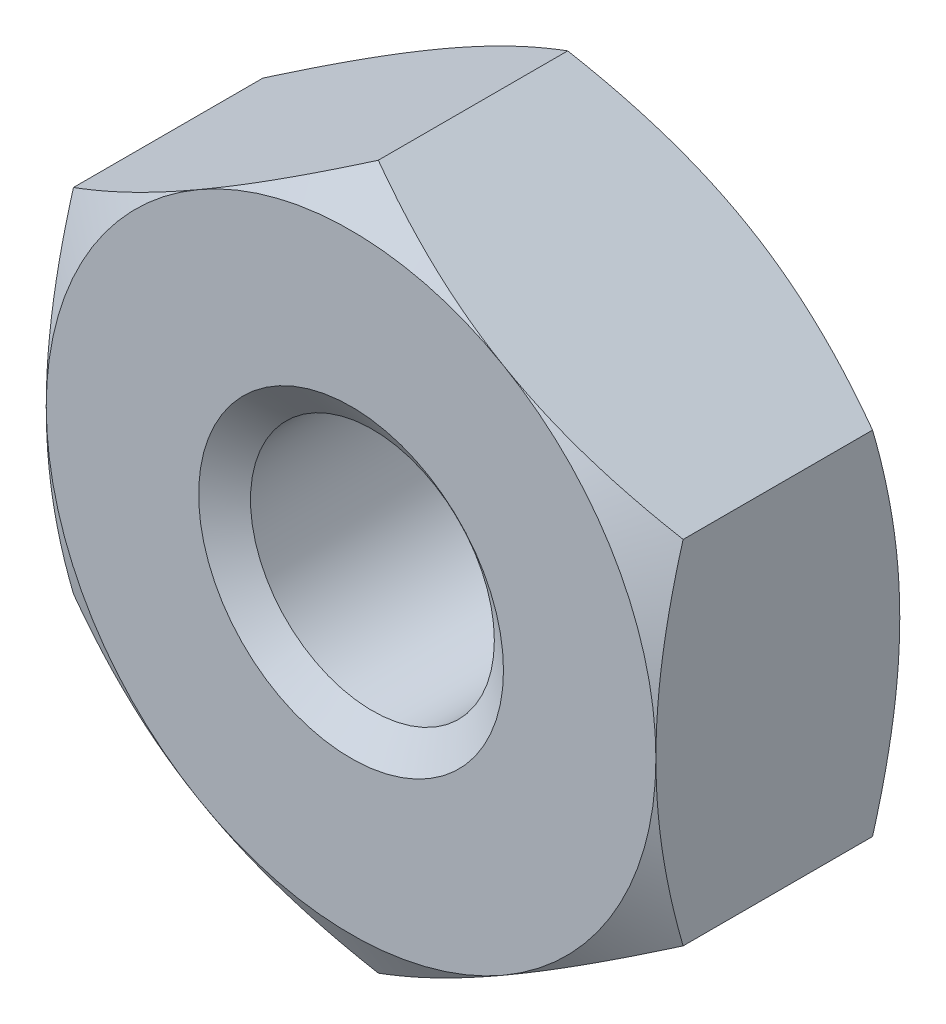
ISO-10303-21;
HEADER;
FILE_DESCRIPTION(('STEP AP214'),'2;1');
FILE_NAME('part.step','',(''),(''),'','','');
FILE_SCHEMA(('AUTOMOTIVE_DESIGN { 1 0 10303 214 1 1 1 1 }'));
ENDSEC;
DATA;
#1=APPLICATION_CONTEXT('core data for automotive mechanical design processes');
#2=APPLICATION_PROTOCOL_DEFINITION('international standard','automotive_design',2000,#1);
#3=PRODUCT_CONTEXT('',#1,'mechanical');
#4=PRODUCT('Part','Part','',(#3));
#5=PRODUCT_RELATED_PRODUCT_CATEGORY('part','',(#4));
#6=PRODUCT_DEFINITION_FORMATION('','',#4);
#7=PRODUCT_DEFINITION_CONTEXT('part definition',#1,'design');
#8=PRODUCT_DEFINITION('design','',#6,#7);
#9=PRODUCT_DEFINITION_SHAPE('','',#8);
#10=(LENGTH_UNIT() NAMED_UNIT(*) SI_UNIT(.MILLI.,.METRE.));
#11=(NAMED_UNIT(*) PLANE_ANGLE_UNIT() SI_UNIT($,.RADIAN.));
#12=(NAMED_UNIT(*) SI_UNIT($,.STERADIAN.) SOLID_ANGLE_UNIT());
#13=UNCERTAINTY_MEASURE_WITH_UNIT(LENGTH_MEASURE(1.E-05),#10,'distance_accuracy_value','');
#14=(GEOMETRIC_REPRESENTATION_CONTEXT(3) GLOBAL_UNCERTAINTY_ASSIGNED_CONTEXT((#13)) GLOBAL_UNIT_ASSIGNED_CONTEXT((#10,
#11,#12)) REPRESENTATION_CONTEXT('',''));
#15=CARTESIAN_POINT('',(0.,0.,0.));
#16=DIRECTION('',(0.,0.,1.));
#17=DIRECTION('',(1.,0.,0.));
#18=AXIS2_PLACEMENT_3D('',#15,#16,#17);
#19=CARTESIAN_POINT('',(0.,0.,-1.6));
#20=DIRECTION('',(0.,0.,1.));
#21=DIRECTION('',(1.,0.,0.));
#22=AXIS2_PLACEMENT_3D('',#19,#20,#21);
#23=CYLINDRICAL_SURFACE('',#22,0.8);
#24=CARTESIAN_POINT('',(0.,0.,-0.140041507641943));
#25=DIRECTION('',(0.,0.,1.));
#26=DIRECTION('',(1.,0.,0.));
#27=AXIS2_PLACEMENT_3D('',#24,#25,#26);
#28=CIRCLE('',#27,0.8);
#29=CARTESIAN_POINT('',(0.8,0.,-0.140041507641943));
#30=VERTEX_POINT('',#29);
#31=EDGE_CURVE('E177',#30,#30,#28,.F.);
#32=ORIENTED_EDGE('',*,*,#31,.F.);
#33=EDGE_LOOP('',(#32));
#34=FACE_BOUND('',#33,.T.);
#35=CARTESIAN_POINT('',(0.,0.,-1.43455849235806));
#36=DIRECTION('',(0.,0.,-1.));
#37=DIRECTION('',(-1.,0.,0.));
#38=AXIS2_PLACEMENT_3D('',#35,#36,#37);
#39=CIRCLE('',#38,0.8);
#40=CARTESIAN_POINT('',(-0.8,0.,-1.43455849235806));
#41=VERTEX_POINT('',#40);
#42=EDGE_CURVE('E41',#41,#41,#39,.F.);
#43=ORIENTED_EDGE('',*,*,#42,.F.);
#44=EDGE_LOOP('',(#43));
#45=FACE_BOUND('',#44,.T.);
#46=ADVANCED_FACE('F36',(#34,#45),#23,.F.);
#47=CARTESIAN_POINT('',(0.,2.3094010767585,-1.6));
#48=DIRECTION('',(-0.500000000000001,0.866025403784438,0.));
#49=DIRECTION('',(-0.866025403784438,-0.500000000000001,0.));
#50=AXIS2_PLACEMENT_3D('',#47,#48,#49);
#51=PLANE('',#50);
#52=DIRECTION('',(0.,0.,1.));
#53=VECTOR('',#52,1.);
#54=CARTESIAN_POINT('',(-2.,1.15470053837925,-1.6));
#55=LINE('',#54,#53);
#56=CARTESIAN_POINT('',(-2.,1.15470053837925,-1.42136720504592));
#57=VERTEX_POINT('',#56);
#58=CARTESIAN_POINT('',(-2.,1.15470053837925,-0.178632794954082));
#59=VERTEX_POINT('',#58);
#60=EDGE_CURVE('E167',#57,#59,#55,.T.);
#61=ORIENTED_EDGE('',*,*,#60,.T.);
#62=CARTESIAN_POINT('',(-2.0002,1.15458506832541,-0.178699466620499));
#63=CARTESIAN_POINT('',(-1.91230873709994,1.20532911262018,-0.14938953610068));
#64=CARTESIAN_POINT('',(-1.82365880552641,1.2565111744778,-0.122732851980467));
#65=CARTESIAN_POINT('',(-1.6448237530022,1.35976164019319,-0.0762024910207214));
#66=CARTESIAN_POINT('',(-1.55463545349496,1.41183187919145,-0.0563452763827795));
#67=CARTESIAN_POINT('',(-1.37537661423669,1.51532701829183,-0.0254334640232528));
#68=CARTESIAN_POINT('',(-1.2863336617737,1.56673599086578,-0.0141731515985314));
#69=CARTESIAN_POINT('',(-1.10782860221496,1.66979593505373,-0.000728662594642099));
#70=CARTESIAN_POINT('',(-1.01836714429604,1.72144653186531,0.00146664504653156));
#71=CARTESIAN_POINT('',(-0.851191646451202,1.81796535054794,-0.00309098933064911));
#72=CARTESIAN_POINT('',(-0.773452629734216,1.86284799277603,-0.00872487468701493));
#73=CARTESIAN_POINT('',(-0.618481085463867,1.95232085557725,-0.0265838952608289));
#74=CARTESIAN_POINT('',(-0.541249094258802,1.99691076648954,-0.03881513602344));
#75=CARTESIAN_POINT('',(-0.385957813517799,2.08656822922816,-0.0693934368676107));
#76=CARTESIAN_POINT('',(-0.307918186892621,2.13162442866767,-0.0878701670657169));
#77=CARTESIAN_POINT('',(-0.153003134307866,2.221064675979,-0.129805518212857));
#78=CARTESIAN_POINT('',(-0.0761257223768802,2.26544987045196,-0.153254280492315));
#79=CARTESIAN_POINT('',(0.000199999999999871,2.30951654681234,-0.1786994666205));
#80=B_SPLINE_CURVE_WITH_KNOTS('',3,(#62,#63,#64,#65,#66,#67,#68,#69,#70,#71,#72,#73,#74,#75,#76,
#77,#78,#79),.UNSPECIFIED.,.F.,.F.,(4,2,2,2,2,2,2,2,4),(0.,0.31703182469561,0.634825876346564,
0.944753967652636,1.25430138000371,1.52387047293094,1.79368946861028,2.06949491027634,
2.34475850821473),.UNSPECIFIED.);
#81=CARTESIAN_POINT('',(-1.,1.73205080756888,0.));
#82=VERTEX_POINT('',#81);
#83=EDGE_CURVE('E63',#59,#82,#80,.T.);
#84=ORIENTED_EDGE('',*,*,#83,.T.);
#85=CARTESIAN_POINT('',(0.,2.3094010767585,-0.178632794954083));
#86=VERTEX_POINT('',#85);
#87=EDGE_CURVE('E246',#82,#86,#80,.T.);
#88=ORIENTED_EDGE('',*,*,#87,.T.);
#89=DIRECTION('',(0.,0.,1.));
#90=VECTOR('',#89,1.);
#91=CARTESIAN_POINT('',(0.,2.3094010767585,-1.6));
#92=LINE('',#91,#90);
#93=CARTESIAN_POINT('',(0.,2.3094010767585,-1.42136720504592));
#94=VERTEX_POINT('',#93);
#95=EDGE_CURVE('E152',#94,#86,#92,.T.);
#96=ORIENTED_EDGE('',*,*,#95,.F.);
#97=CARTESIAN_POINT('',(-2.0002,1.15458506832541,-1.4213005333795));
#98=CARTESIAN_POINT('',(-1.91230873709994,1.20532911262018,-1.45061046389932));
#99=CARTESIAN_POINT('',(-1.82365880552641,1.2565111744778,-1.47726714801953));
#100=CARTESIAN_POINT('',(-1.6448237530022,1.35976164019319,-1.52379750897928));
#101=CARTESIAN_POINT('',(-1.55463545349496,1.41183187919145,-1.54365472361722));
#102=CARTESIAN_POINT('',(-1.37537661423669,1.51532701829183,-1.57456653597675));
#103=CARTESIAN_POINT('',(-1.2863336617737,1.56673599086578,-1.58582684840147));
#104=CARTESIAN_POINT('',(-1.10782860221496,1.66979593505373,-1.59927133740536));
#105=CARTESIAN_POINT('',(-1.01836714429604,1.72144653186531,-1.60146664504653));
#106=CARTESIAN_POINT('',(-0.851191646451202,1.81796535054794,-1.59690901066935));
#107=CARTESIAN_POINT('',(-0.773452629734216,1.86284799277603,-1.59127512531299));
#108=CARTESIAN_POINT('',(-0.618481085463867,1.95232085557725,-1.57341610473917));
#109=CARTESIAN_POINT('',(-0.541249094258802,1.99691076648954,-1.56118486397656));
#110=CARTESIAN_POINT('',(-0.3859578135178,2.08656822922816,-1.53060656313239));
#111=CARTESIAN_POINT('',(-0.307918186892621,2.13162442866767,-1.51212983293428));
#112=CARTESIAN_POINT('',(-0.153003134307866,2.221064675979,-1.47019448178714));
#113=CARTESIAN_POINT('',(-0.07612572237688,2.26544987045196,-1.44674571950769));
#114=CARTESIAN_POINT('',(0.00019999999999987,2.30951654681234,-1.4213005333795));
#115=B_SPLINE_CURVE_WITH_KNOTS('',3,(#97,#98,#99,#100,#101,#102,#103,#104,#105,#106,#107,#108,
#109,#110,#111,#112,#113,#114),.UNSPECIFIED.,.F.,.F.,(4,2,2,2,2,2,2,2,4),(0.,0.31703182469561,
0.634825876346564,0.944753967652636,1.25430138000371,1.52387047293094,1.79368946861028,
2.06949491027634,2.34475850821473),.UNSPECIFIED.);
#116=CARTESIAN_POINT('',(-1.,1.73205080756888,-1.6));
#117=VERTEX_POINT('',#116);
#118=EDGE_CURVE('E170',#117,#94,#115,.T.);
#119=ORIENTED_EDGE('',*,*,#118,.F.);
#120=EDGE_CURVE('E269',#57,#117,#115,.T.);
#121=ORIENTED_EDGE('',*,*,#120,.F.);
#122=EDGE_LOOP('',(#61,#84,#88,#96,#119,#121));
#123=FACE_BOUND('',#122,.T.);
#124=ADVANCED_FACE('F38',(#123),#51,.T.);
#125=CARTESIAN_POINT('',(2.,1.15470053837925,-1.6));
#126=DIRECTION('',(0.5,0.866025403784438,0.));
#127=DIRECTION('',(-0.866025403784438,0.5,0.));
#128=AXIS2_PLACEMENT_3D('',#125,#126,#127);
#129=PLANE('',#128);
#130=ORIENTED_EDGE('',*,*,#95,.T.);
#131=CARTESIAN_POINT('',(-0.000200000000000259,2.30951654681234,-0.1786994666205));
#132=CARTESIAN_POINT('',(0.0876912629000598,2.25877250251758,-0.14938953610068));
#133=CARTESIAN_POINT('',(0.176341194473591,2.20759044065996,-0.122732851980468));
#134=CARTESIAN_POINT('',(0.355176246997802,2.10433997494456,-0.0762024910207218));
#135=CARTESIAN_POINT('',(0.445364546505036,2.05226973594631,-0.0563452763827798));
#136=CARTESIAN_POINT('',(0.624623385763306,1.94877459684592,-0.0254334640232529));
#137=CARTESIAN_POINT('',(0.713666338226304,1.89736562427197,-0.0141731515985314));
#138=CARTESIAN_POINT('',(0.892171397785043,1.79430568008402,-0.000728662594641965));
#139=CARTESIAN_POINT('',(0.981632855703959,1.74265508327244,0.00146664504653171));
#140=CARTESIAN_POINT('',(1.1488083535488,1.64613626458981,-0.00309098933064889));
#141=CARTESIAN_POINT('',(1.22654737026578,1.60125362236173,-0.00872487468701465));
#142=CARTESIAN_POINT('',(1.38151891453613,1.51178075956051,-0.0265838952608285));
#143=CARTESIAN_POINT('',(1.4587509057412,1.46719084864821,-0.0388151360234396));
#144=CARTESIAN_POINT('',(1.6140421864822,1.37753338590959,-0.0693934368676103));
#145=CARTESIAN_POINT('',(1.69208181310738,1.33247718647009,-0.0878701670657165));
#146=CARTESIAN_POINT('',(1.84699686569213,1.24303693915875,-0.129805518212857));
#147=CARTESIAN_POINT('',(1.92387427762312,1.1986517446858,-0.153254280492314));
#148=CARTESIAN_POINT('',(2.0002,1.15458506832541,-0.178699466620499));
#149=B_SPLINE_CURVE_WITH_KNOTS('',3,(#131,#132,#133,#134,#135,#136,#137,#138,#139,#140,#141,
#142,#143,#144,#145,#146,#147,#148),.UNSPECIFIED.,.F.,.F.,(4,2,2,2,2,2,2,2,4),(0.,
0.31703182469561,0.634825876346564,0.944753967652637,1.25430138000371,1.52387047293094,
1.79368946861028,2.06949491027634,2.34475850821473),.UNSPECIFIED.);
#150=CARTESIAN_POINT('',(1.,1.73205080756888,0.));
#151=VERTEX_POINT('',#150);
#152=EDGE_CURVE('E145',#86,#151,#149,.T.);
#153=ORIENTED_EDGE('',*,*,#152,.T.);
#154=CARTESIAN_POINT('',(2.,1.15470053837925,-0.178632794954083));
#155=VERTEX_POINT('',#154);
#156=EDGE_CURVE('E131',#151,#155,#149,.T.);
#157=ORIENTED_EDGE('',*,*,#156,.T.);
#158=DIRECTION('',(0.,0.,1.));
#159=VECTOR('',#158,1.);
#160=CARTESIAN_POINT('',(2.,1.15470053837925,-1.6));
#161=LINE('',#160,#159);
#162=CARTESIAN_POINT('',(2.,1.15470053837925,-1.42136720504592));
#163=VERTEX_POINT('',#162);
#164=EDGE_CURVE('E144',#163,#155,#161,.T.);
#165=ORIENTED_EDGE('',*,*,#164,.F.);
#166=CARTESIAN_POINT('',(-0.000200000000000273,2.30951654681234,-1.4213005333795));
#167=CARTESIAN_POINT('',(0.0876912629000596,2.25877250251758,-1.45061046389932));
#168=CARTESIAN_POINT('',(0.176341194473591,2.20759044065996,-1.47726714801953));
#169=CARTESIAN_POINT('',(0.355176246997802,2.10433997494456,-1.52379750897928));
#170=CARTESIAN_POINT('',(0.445364546505036,2.05226973594631,-1.54365472361722));
#171=CARTESIAN_POINT('',(0.624623385763306,1.94877459684592,-1.57456653597675));
#172=CARTESIAN_POINT('',(0.713666338226304,1.89736562427197,-1.58582684840147));
#173=CARTESIAN_POINT('',(0.892171397785043,1.79430568008402,-1.59927133740536));
#174=CARTESIAN_POINT('',(0.981632855703959,1.74265508327244,-1.60146664504653));
#175=CARTESIAN_POINT('',(1.1488083535488,1.64613626458981,-1.59690901066935));
#176=CARTESIAN_POINT('',(1.22654737026578,1.60125362236173,-1.59127512531299));
#177=CARTESIAN_POINT('',(1.38151891453613,1.51178075956051,-1.57341610473917));
#178=CARTESIAN_POINT('',(1.4587509057412,1.46719084864821,-1.56118486397656));
#179=CARTESIAN_POINT('',(1.6140421864822,1.37753338590959,-1.53060656313239));
#180=CARTESIAN_POINT('',(1.69208181310738,1.33247718647009,-1.51212983293428));
#181=CARTESIAN_POINT('',(1.84699686569213,1.24303693915875,-1.47019448178714));
#182=CARTESIAN_POINT('',(1.92387427762312,1.1986517446858,-1.44674571950769));
#183=CARTESIAN_POINT('',(2.0002,1.15458506832541,-1.4213005333795));
#184=B_SPLINE_CURVE_WITH_KNOTS('',3,(#166,#167,#168,#169,#170,#171,#172,#173,#174,#175,#176,
#177,#178,#179,#180,#181,#182,#183),.UNSPECIFIED.,.F.,.F.,(4,2,2,2,2,2,2,2,4),(0.,
0.31703182469561,0.634825876346564,0.944753967652637,1.25430138000371,1.52387047293094,
1.79368946861028,2.06949491027634,2.34475850821473),.UNSPECIFIED.);
#185=CARTESIAN_POINT('',(1.,1.73205080756888,-1.6));
#186=VERTEX_POINT('',#185);
#187=EDGE_CURVE('E262',#186,#163,#184,.T.);
#188=ORIENTED_EDGE('',*,*,#187,.F.);
#189=EDGE_CURVE('E268',#94,#186,#184,.T.);
#190=ORIENTED_EDGE('',*,*,#189,.F.);
#191=EDGE_LOOP('',(#130,#153,#157,#165,#188,#190));
#192=FACE_BOUND('',#191,.T.);
#193=ADVANCED_FACE('F142',(#192),#129,.T.);
#194=CARTESIAN_POINT('',(2.,1.15470053837925,-1.6));
#195=DIRECTION('',(-1.,0.,0.));
#196=DIRECTION('',(0.,0.,1.));
#197=AXIS2_PLACEMENT_3D('',#194,#195,#196);
#198=PLANE('',#197);
#199=CARTESIAN_POINT('',(2.,-3.06243599497946,-0.957053410620322));
#200=CARTESIAN_POINT('',(2.,-2.97462468513202,-0.914618135332453));
#201=CARTESIAN_POINT('',(2.,-2.88660576044574,-0.872604701878199));
#202=CARTESIAN_POINT('',(2.,-2.71004042392046,-0.789662573424089));
#203=CARTESIAN_POINT('',(2.,-2.62149392396102,-0.748734066234633));
#204=CARTESIAN_POINT('',(2.,-2.44328285836993,-0.667987231477972));
#205=CARTESIAN_POINT('',(2.,-2.3536147942302,-0.628176597351501));
#206=CARTESIAN_POINT('',(2.,-2.17354167395292,-0.55026529289016));
#207=CARTESIAN_POINT('',(2.,-2.08313665652235,-0.512164533422732));
#208=CARTESIAN_POINT('',(2.,-1.90031404940485,-0.437671460362099));
#209=CARTESIAN_POINT('',(2.,-1.80788540023433,-0.401306140224328));
#210=CARTESIAN_POINT('',(2.,-1.62195694964761,-0.331431205515075));
#211=CARTESIAN_POINT('',(2.,-1.52845725096658,-0.297921319609402));
#212=CARTESIAN_POINT('',(2.,-1.34040158791134,-0.234645877627143));
#213=CARTESIAN_POINT('',(2.,-1.24584820361334,-0.204872731943686));
#214=CARTESIAN_POINT('',(2.,-1.05539728812543,-0.150041663725098));
#215=CARTESIAN_POINT('',(2.,-0.959500192348563,-0.124982250068513));
#216=CARTESIAN_POINT('',(2.,-0.766296107056175,-0.0807954522614518));
#217=CARTESIAN_POINT('',(2.,-0.668988749343052,-0.0616696475902393));
#218=CARTESIAN_POINT('',(2.,-0.47320157375166,-0.0306369133490218));
#219=CARTESIAN_POINT('',(2.,-0.374721754836866,-0.0187299901614154));
#220=CARTESIAN_POINT('',(2.,-0.177725213014457,-0.00319166535968512));
#221=CARTESIAN_POINT('',(2.,-0.0792127464695938,0.000492126942978438));
#222=CARTESIAN_POINT('',(2.,0.117733134481546,-0.000599210482845903));
#223=CARTESIAN_POINT('',(2.,0.216166562771044,-0.00537214444611039));
#224=CARTESIAN_POINT('',(2.,0.454297223248125,-0.0267243139120268));
#225=CARTESIAN_POINT('',(2.,0.593620477818539,-0.0474829418890649));
#226=CARTESIAN_POINT('',(2.,0.869689306254773,-0.10219949427068));
#227=CARTESIAN_POINT('',(2.,1.00643164818022,-0.136172948124204));
#228=CARTESIAN_POINT('',(2.,1.21108706615395,-0.194758945655362));
#229=CARTESIAN_POINT('',(2.,1.28004655189501,-0.215857177032567));
#230=CARTESIAN_POINT('',(2.,1.41724192464572,-0.260142084128329));
#231=CARTESIAN_POINT('',(2.,1.48547827495749,-0.283327319381158));
#232=CARTESIAN_POINT('',(2.,1.62094688255353,-0.33130290797197));
#233=CARTESIAN_POINT('',(2.,1.68818262968755,-0.356083492073603));
#234=CARTESIAN_POINT('',(2.,1.82213246587635,-0.407099147686617));
#235=CARTESIAN_POINT('',(2.,1.88884633148565,-0.433334807052328));
#236=CARTESIAN_POINT('',(2.,1.95531849493342,-0.460154503270897));
#237=B_SPLINE_CURVE_WITH_KNOTS('',3,(#199,#200,#201,#202,#203,#204,#205,#206,#207,#208,#209,
#210,#211,#212,#213,#214,#215,#216,#217,#218,#219,#220,#221,#222,#223,#224,#225,#226,#227,#228,
#229,#230,#231,#232,#233,#234,#235,#236),.UNSPECIFIED.,.F.,.F.,(4,2,2,2,2,2,2,2,2,2,2,2,2,2,2,2,
2,2,4),(0.,0.292585896266135,0.585222115299634,0.879532973229948,1.17382847142413,
1.47176772581358,1.76967863724007,2.06697432467463,2.36417580814398,2.66145633652585,
2.95873712774069,3.25411843045681,3.54942304948605,3.97114178181684,4.39335760296179,
4.60967655565109,4.82584733174413,5.04080135347749,5.25584285892498),.UNSPECIFIED.);
#238=CARTESIAN_POINT('',(2.,-1.15470053837925,-0.178632794954083));
#239=VERTEX_POINT('',#238);
#240=CARTESIAN_POINT('',(2.,0.,0.));
#241=VERTEX_POINT('',#240);
#242=EDGE_CURVE('E137',#239,#241,#237,.T.);
#243=ORIENTED_EDGE('',*,*,#242,.F.);
#244=DIRECTION('',(0.,0.,1.));
#245=VECTOR('',#244,1.);
#246=CARTESIAN_POINT('',(2.,-1.15470053837925,-1.6));
#247=LINE('',#246,#245);
#248=CARTESIAN_POINT('',(2.,-1.15470053837925,-1.42136720504592));
#249=VERTEX_POINT('',#248);
#250=EDGE_CURVE('E153',#249,#239,#247,.T.);
#251=ORIENTED_EDGE('',*,*,#250,.F.);
#252=CARTESIAN_POINT('',(2.,-3.06243599497946,-0.642946589379678));
#253=CARTESIAN_POINT('',(2.,-2.97462468513202,-0.685381864667548));
#254=CARTESIAN_POINT('',(2.,-2.88660576044574,-0.727395298121801));
#255=CARTESIAN_POINT('',(2.,-2.71004042392046,-0.810337426575911));
#256=CARTESIAN_POINT('',(2.,-2.62149392396102,-0.851265933765367));
#257=CARTESIAN_POINT('',(2.,-2.44328285836993,-0.932012768522028));
#258=CARTESIAN_POINT('',(2.,-2.3536147942302,-0.9718234026485));
#259=CARTESIAN_POINT('',(2.,-2.17354167395292,-1.04973470710984));
#260=CARTESIAN_POINT('',(2.,-2.08313665652235,-1.08783546657727));
#261=CARTESIAN_POINT('',(2.,-1.90031404940485,-1.1623285396379));
#262=CARTESIAN_POINT('',(2.,-1.80788540023433,-1.19869385977567));
#263=CARTESIAN_POINT('',(2.,-1.62195694964761,-1.26856879448493));
#264=CARTESIAN_POINT('',(2.,-1.52845725096658,-1.3020786803906));
#265=CARTESIAN_POINT('',(2.,-1.34040158791134,-1.36535412237286));
#266=CARTESIAN_POINT('',(2.,-1.24584820361334,-1.39512726805631));
#267=CARTESIAN_POINT('',(2.,-1.05539728812543,-1.4499583362749));
#268=CARTESIAN_POINT('',(2.,-0.959500192348563,-1.47501774993149));
#269=CARTESIAN_POINT('',(2.,-0.766296107056175,-1.51920454773855));
#270=CARTESIAN_POINT('',(2.,-0.668988749343052,-1.53833035240976));
#271=CARTESIAN_POINT('',(2.,-0.47320157375166,-1.56936308665098));
#272=CARTESIAN_POINT('',(2.,-0.374721754836866,-1.58127000983858));
#273=CARTESIAN_POINT('',(2.,-0.177725213014457,-1.59680833464032));
#274=CARTESIAN_POINT('',(2.,-0.0792127464695939,-1.60049212694298));
#275=CARTESIAN_POINT('',(2.,0.117733134481546,-1.59940078951715));
#276=CARTESIAN_POINT('',(2.,0.216166562771044,-1.59462785555389));
#277=CARTESIAN_POINT('',(2.,0.454297223248125,-1.57327568608797));
#278=CARTESIAN_POINT('',(2.,0.59362047781854,-1.55251705811094));
#279=CARTESIAN_POINT('',(2.,0.869689306254773,-1.49780050572932));
#280=CARTESIAN_POINT('',(2.,1.00643164818022,-1.4638270518758));
#281=CARTESIAN_POINT('',(2.,1.21108706615395,-1.40524105434464));
#282=CARTESIAN_POINT('',(2.,1.28004655189501,-1.38414282296743));
#283=CARTESIAN_POINT('',(2.,1.41724192464572,-1.33985791587167));
#284=CARTESIAN_POINT('',(2.,1.48547827495749,-1.31667268061884));
#285=CARTESIAN_POINT('',(2.,1.62094688255353,-1.26869709202803));
#286=CARTESIAN_POINT('',(2.,1.68818262968755,-1.2439165079264));
#287=CARTESIAN_POINT('',(2.,1.82213246587635,-1.19290085231338));
#288=CARTESIAN_POINT('',(2.,1.88884633148565,-1.16666519294767));
#289=CARTESIAN_POINT('',(2.,1.95531849493342,-1.1398454967291));
#290=B_SPLINE_CURVE_WITH_KNOTS('',3,(#252,#253,#254,#255,#256,#257,#258,#259,#260,#261,#262,
#263,#264,#265,#266,#267,#268,#269,#270,#271,#272,#273,#274,#275,#276,#277,#278,#279,#280,#281,
#282,#283,#284,#285,#286,#287,#288,#289),.UNSPECIFIED.,.F.,.F.,(4,2,2,2,2,2,2,2,2,2,2,2,2,2,2,2,
2,2,4),(0.,0.292585896266136,0.585222115299634,0.879532973229949,1.17382847142413,
1.47176772581358,1.76967863724007,2.06697432467463,2.36417580814398,2.66145633652585,
2.95873712774069,3.25411843045681,3.54942304948606,3.97114178181684,4.39335760296179,
4.60967655565109,4.82584733174413,5.04080135347749,5.25584285892498),.UNSPECIFIED.);
#291=CARTESIAN_POINT('',(2.,0.,-1.6));
#292=VERTEX_POINT('',#291);
#293=EDGE_CURVE('E275',#249,#292,#290,.T.);
#294=ORIENTED_EDGE('',*,*,#293,.T.);
#295=EDGE_CURVE('E151',#292,#163,#290,.T.);
#296=ORIENTED_EDGE('',*,*,#295,.T.);
#297=ORIENTED_EDGE('',*,*,#164,.T.);
#298=EDGE_CURVE('E128',#241,#155,#237,.T.);
#299=ORIENTED_EDGE('',*,*,#298,.F.);
#300=EDGE_LOOP('',(#243,#251,#294,#296,#297,#299));
#301=FACE_BOUND('',#300,.T.);
#302=ADVANCED_FACE('F148',(#301),#198,.F.);
#303=CARTESIAN_POINT('',(0.,-2.30940107675851,-1.6));
#304=DIRECTION('',(0.500000000000001,-0.866025403784438,0.));
#305=DIRECTION('',(0.866025403784438,0.500000000000001,0.));
#306=AXIS2_PLACEMENT_3D('',#303,#304,#305);
#307=PLANE('',#306);
#308=ORIENTED_EDGE('',*,*,#250,.T.);
#309=CARTESIAN_POINT('',(2.0002,-1.15458506832542,-0.1786994666205));
#310=CARTESIAN_POINT('',(1.91230873709994,-1.20532911262018,-0.149389536100681));
#311=CARTESIAN_POINT('',(1.82365880552641,-1.2565111744778,-0.122732851980469));
#312=CARTESIAN_POINT('',(1.6448237530022,-1.3597616401932,-0.0762024910207228));
#313=CARTESIAN_POINT('',(1.55463545349496,-1.41183187919145,-0.0563452763827809));
#314=CARTESIAN_POINT('',(1.37537661423669,-1.51532701829184,-0.0254334640232544));
#315=CARTESIAN_POINT('',(1.2863336617737,-1.56673599086579,-0.014173151598533));
#316=CARTESIAN_POINT('',(1.10782860221496,-1.66979593505374,-0.000728662594643875));
#317=CARTESIAN_POINT('',(1.01836714429604,-1.72144653186532,0.00146664504652966));
#318=CARTESIAN_POINT('',(0.851191646451202,-1.81796535054795,-0.00309098933065132));
#319=CARTESIAN_POINT('',(0.773452629734216,-1.86284799277603,-0.0087248746870173));
#320=CARTESIAN_POINT('',(0.618481085463867,-1.95232085557725,-0.0265838952608314));
#321=CARTESIAN_POINT('',(0.541249094258802,-1.99691076648955,-0.0388151360234426));
#322=CARTESIAN_POINT('',(0.385957813517799,-2.08656822922817,-0.0693934368676133));
#323=CARTESIAN_POINT('',(0.307918186892621,-2.13162442866767,-0.0878701670657196));
#324=CARTESIAN_POINT('',(0.153003134307866,-2.22106467597901,-0.12980551821286));
#325=CARTESIAN_POINT('',(0.0761257223768804,-2.26544987045196,-0.153254280492318));
#326=CARTESIAN_POINT('',(-0.000199999999999611,-2.30951654681235,-0.178699466620502));
#327=B_SPLINE_CURVE_WITH_KNOTS('',3,(#309,#310,#311,#312,#313,#314,#315,#316,#317,#318,#319,
#320,#321,#322,#323,#324,#325,#326),.UNSPECIFIED.,.F.,.F.,(4,2,2,2,2,2,2,2,4),(0.,
0.31703182469561,0.634825876346564,0.944753967652637,1.25430138000371,1.52387047293094,
1.79368946861028,2.06949491027634,2.34475850821473),.UNSPECIFIED.);
#328=CARTESIAN_POINT('',(1.,-1.73205080756888,0.));
#329=VERTEX_POINT('',#328);
#330=EDGE_CURVE('E550',#239,#329,#327,.T.);
#331=ORIENTED_EDGE('',*,*,#330,.T.);
#332=CARTESIAN_POINT('',(0.,-2.3094010767585,-0.178632794954083));
#333=VERTEX_POINT('',#332);
#334=EDGE_CURVE('E230',#329,#333,#327,.T.);
#335=ORIENTED_EDGE('',*,*,#334,.T.);
#336=DIRECTION('',(0.,0.,1.));
#337=VECTOR('',#336,1.);
#338=CARTESIAN_POINT('',(0.,-2.30940107675851,-1.6));
#339=LINE('',#338,#337);
#340=CARTESIAN_POINT('',(0.,-2.3094010767585,-1.42136720504592));
#341=VERTEX_POINT('',#340);
#342=EDGE_CURVE('E158',#341,#333,#339,.T.);
#343=ORIENTED_EDGE('',*,*,#342,.F.);
#344=CARTESIAN_POINT('',(2.0002,-1.15458506832542,-1.4213005333795));
#345=CARTESIAN_POINT('',(1.91230873709994,-1.20532911262018,-1.45061046389932));
#346=CARTESIAN_POINT('',(1.82365880552641,-1.2565111744778,-1.47726714801953));
#347=CARTESIAN_POINT('',(1.6448237530022,-1.3597616401932,-1.52379750897928));
#348=CARTESIAN_POINT('',(1.55463545349496,-1.41183187919145,-1.54365472361722));
#349=CARTESIAN_POINT('',(1.37537661423669,-1.51532701829184,-1.57456653597675));
#350=CARTESIAN_POINT('',(1.2863336617737,-1.56673599086579,-1.58582684840147));
#351=CARTESIAN_POINT('',(1.10782860221496,-1.66979593505374,-1.59927133740536));
#352=CARTESIAN_POINT('',(1.01836714429604,-1.72144653186532,-1.60146664504653));
#353=CARTESIAN_POINT('',(0.851191646451202,-1.81796535054795,-1.59690901066935));
#354=CARTESIAN_POINT('',(0.773452629734216,-1.86284799277603,-1.59127512531298));
#355=CARTESIAN_POINT('',(0.618481085463867,-1.95232085557725,-1.57341610473917));
#356=CARTESIAN_POINT('',(0.541249094258802,-1.99691076648955,-1.56118486397656));
#357=CARTESIAN_POINT('',(0.385957813517799,-2.08656822922817,-1.53060656313239));
#358=CARTESIAN_POINT('',(0.307918186892621,-2.13162442866767,-1.51212983293428));
#359=CARTESIAN_POINT('',(0.153003134307866,-2.22106467597901,-1.47019448178714));
#360=CARTESIAN_POINT('',(0.0761257223768804,-2.26544987045196,-1.44674571950768));
#361=CARTESIAN_POINT('',(-0.000199999999999608,-2.30951654681235,-1.4213005333795));
#362=B_SPLINE_CURVE_WITH_KNOTS('',3,(#344,#345,#346,#347,#348,#349,#350,#351,#352,#353,#354,
#355,#356,#357,#358,#359,#360,#361),.UNSPECIFIED.,.F.,.F.,(4,2,2,2,2,2,2,2,4),(0.,
0.31703182469561,0.634825876346564,0.944753967652637,1.25430138000371,1.52387047293094,
1.79368946861028,2.06949491027634,2.34475850821473),.UNSPECIFIED.);
#363=CARTESIAN_POINT('',(1.,-1.73205080756888,-1.6));
#364=VERTEX_POINT('',#363);
#365=EDGE_CURVE('E282',#364,#341,#362,.T.);
#366=ORIENTED_EDGE('',*,*,#365,.F.);
#367=EDGE_CURVE('E281',#249,#364,#362,.T.);
#368=ORIENTED_EDGE('',*,*,#367,.F.);
#369=EDGE_LOOP('',(#308,#331,#335,#343,#366,#368));
#370=FACE_BOUND('',#369,.T.);
#371=ADVANCED_FACE('F294',(#370),#307,.T.);
#372=CARTESIAN_POINT('',(-2.,-1.15470053837925,-1.6));
#373=DIRECTION('',(-0.500000000000001,-0.866025403784438,0.));
#374=DIRECTION('',(0.866025403784438,-0.500000000000001,0.));
#375=AXIS2_PLACEMENT_3D('',#372,#373,#374);
#376=PLANE('',#375);
#377=ORIENTED_EDGE('',*,*,#342,.T.);
#378=CARTESIAN_POINT('',(0.000200000000000292,-2.30951654681235,-0.178699466620503));
#379=CARTESIAN_POINT('',(-0.0876912629000601,-2.25877250251758,-0.149389536100684));
#380=CARTESIAN_POINT('',(-0.176341194473592,-2.20759044065996,-0.122732851980471));
#381=CARTESIAN_POINT('',(-0.355176246997803,-2.10433997494457,-0.0762024910207247));
#382=CARTESIAN_POINT('',(-0.445364546505037,-2.05226973594631,-0.0563452763827823));
#383=CARTESIAN_POINT('',(-0.624623385763307,-1.94877459684593,-0.0254334640232554));
#384=CARTESIAN_POINT('',(-0.713666338226306,-1.89736562427198,-0.0141731515985341));
#385=CARTESIAN_POINT('',(-0.892171397785045,-1.79430568008403,-0.000728662594644532));
#386=CARTESIAN_POINT('',(-0.98163285570396,-1.74265508327245,0.00146664504652947));
#387=CARTESIAN_POINT('',(-1.1488083535488,-1.64613626458982,-0.00309098933065109));
#388=CARTESIAN_POINT('',(-1.22654737026579,-1.60125362236173,-0.00872487468701703));
#389=CARTESIAN_POINT('',(-1.38151891453614,-1.51178075956051,-0.0265838952608309));
#390=CARTESIAN_POINT('',(-1.4587509057412,-1.46719084864821,-0.0388151360234418));
#391=CARTESIAN_POINT('',(-1.6140421864822,-1.3775333859096,-0.0693934368676121));
#392=CARTESIAN_POINT('',(-1.69208181310738,-1.33247718647009,-0.087870167065718));
#393=CARTESIAN_POINT('',(-1.84699686569213,-1.24303693915876,-0.129805518212858));
#394=CARTESIAN_POINT('',(-1.92387427762312,-1.1986517446858,-0.153254280492315));
#395=CARTESIAN_POINT('',(-2.0002,-1.15458506832542,-0.1786994666205));
#396=B_SPLINE_CURVE_WITH_KNOTS('',3,(#378,#379,#380,#381,#382,#383,#384,#385,#386,#387,#388,
#389,#390,#391,#392,#393,#394,#395),.UNSPECIFIED.,.F.,.F.,(4,2,2,2,2,2,2,2,4),(0.,
0.317031824695611,0.634825876346566,0.944753967652639,1.25430138000372,1.52387047293094,
1.79368946861029,2.06949491027634,2.34475850821473),.UNSPECIFIED.);
#397=CARTESIAN_POINT('',(-1.,-1.73205080756888,0.));
#398=VERTEX_POINT('',#397);
#399=EDGE_CURVE('E548',#333,#398,#396,.T.);
#400=ORIENTED_EDGE('',*,*,#399,.T.);
#401=CARTESIAN_POINT('',(-2.,-1.15470053837925,-0.178632794954083));
#402=VERTEX_POINT('',#401);
#403=EDGE_CURVE('E202',#398,#402,#396,.T.);
#404=ORIENTED_EDGE('',*,*,#403,.T.);
#405=DIRECTION('',(0.,0.,1.));
#406=VECTOR('',#405,1.);
#407=CARTESIAN_POINT('',(-2.,-1.15470053837925,-1.6));
#408=LINE('',#407,#406);
#409=CARTESIAN_POINT('',(-2.,-1.15470053837925,-1.42136720504592));
#410=VERTEX_POINT('',#409);
#411=EDGE_CURVE('E164',#410,#402,#408,.T.);
#412=ORIENTED_EDGE('',*,*,#411,.F.);
#413=CARTESIAN_POINT('',(0.000200000000000188,-2.30951654681235,-1.4213005333795));
#414=CARTESIAN_POINT('',(-0.0876912629000601,-2.25877250251758,-1.45061046389932));
#415=CARTESIAN_POINT('',(-0.176341194473592,-2.20759044065996,-1.47726714801953));
#416=CARTESIAN_POINT('',(-0.355176246997803,-2.10433997494457,-1.52379750897928));
#417=CARTESIAN_POINT('',(-0.445364546505038,-2.05226973594631,-1.54365472361722));
#418=CARTESIAN_POINT('',(-0.624623385763307,-1.94877459684593,-1.57456653597674));
#419=CARTESIAN_POINT('',(-0.713666338226306,-1.89736562427198,-1.58582684840147));
#420=CARTESIAN_POINT('',(-0.892171397785045,-1.79430568008403,-1.59927133740536));
#421=CARTESIAN_POINT('',(-0.981632855703961,-1.74265508327245,-1.60146664504653));
#422=CARTESIAN_POINT('',(-1.1488083535488,-1.64613626458982,-1.59690901066935));
#423=CARTESIAN_POINT('',(-1.22654737026579,-1.60125362236173,-1.59127512531298));
#424=CARTESIAN_POINT('',(-1.38151891453614,-1.51178075956051,-1.57341610473917));
#425=CARTESIAN_POINT('',(-1.4587509057412,-1.46719084864821,-1.56118486397656));
#426=CARTESIAN_POINT('',(-1.6140421864822,-1.37753338590959,-1.53060656313239));
#427=CARTESIAN_POINT('',(-1.69208181310738,-1.33247718647009,-1.51212983293428));
#428=CARTESIAN_POINT('',(-1.84699686569214,-1.24303693915876,-1.47019448178714));
#429=CARTESIAN_POINT('',(-1.92387427762312,-1.1986517446858,-1.44674571950768));
#430=CARTESIAN_POINT('',(-2.0002,-1.15458506832542,-1.4213005333795));
#431=B_SPLINE_CURVE_WITH_KNOTS('',3,(#413,#414,#415,#416,#417,#418,#419,#420,#421,#422,#423,
#424,#425,#426,#427,#428,#429,#430),.UNSPECIFIED.,.F.,.F.,(4,2,2,2,2,2,2,2,4),(0.,
0.317031824695611,0.634825876346566,0.944753967652639,1.25430138000372,1.52387047293094,
1.79368946861029,2.06949491027634,2.34475850821473),.UNSPECIFIED.);
#432=CARTESIAN_POINT('',(-1.,-1.73205080756888,-1.6));
#433=VERTEX_POINT('',#432);
#434=EDGE_CURVE('E289',#433,#410,#431,.T.);
#435=ORIENTED_EDGE('',*,*,#434,.F.);
#436=EDGE_CURVE('E288',#341,#433,#431,.T.);
#437=ORIENTED_EDGE('',*,*,#436,.F.);
#438=EDGE_LOOP('',(#377,#400,#404,#412,#435,#437));
#439=FACE_BOUND('',#438,.T.);
#440=ADVANCED_FACE('F297',(#439),#376,.T.);
#441=CARTESIAN_POINT('',(-2.,1.15470053837925,-1.6));
#442=DIRECTION('',(-1.,0.,0.));
#443=DIRECTION('',(0.,0.,1.));
#444=AXIS2_PLACEMENT_3D('',#441,#442,#443);
#445=PLANE('',#444);
#446=ORIENTED_EDGE('',*,*,#411,.T.);
#447=CARTESIAN_POINT('',(-2.,-3.06243599497946,-0.957053410620322));
#448=CARTESIAN_POINT('',(-2.,-2.97462468513202,-0.914618135332453));
#449=CARTESIAN_POINT('',(-2.,-2.88660576044575,-0.872604701878199));
#450=CARTESIAN_POINT('',(-2.,-2.71004042392046,-0.789662573424089));
#451=CARTESIAN_POINT('',(-2.,-2.62149392396103,-0.748734066234633));
#452=CARTESIAN_POINT('',(-2.,-2.44328285836993,-0.667987231477973));
#453=CARTESIAN_POINT('',(-2.,-2.3536147942302,-0.628176597351501));
#454=CARTESIAN_POINT('',(-2.,-2.17354167395292,-0.550265292890161));
#455=CARTESIAN_POINT('',(-2.,-2.08313665652235,-0.512164533422732));
#456=CARTESIAN_POINT('',(-2.,-1.90031404940485,-0.437671460362099));
#457=CARTESIAN_POINT('',(-2.,-1.80788540023433,-0.401306140224328));
#458=CARTESIAN_POINT('',(-2.,-1.62195694964761,-0.331431205515075));
#459=CARTESIAN_POINT('',(-2.,-1.52845725096658,-0.297921319609402));
#460=CARTESIAN_POINT('',(-2.,-1.34040158791134,-0.234645877627143));
#461=CARTESIAN_POINT('',(-2.,-1.24584820361334,-0.204872731943686));
#462=CARTESIAN_POINT('',(-2.,-1.05539728812543,-0.150041663725098));
#463=CARTESIAN_POINT('',(-2.,-0.959500192348563,-0.124982250068512));
#464=CARTESIAN_POINT('',(-2.,-0.766296107056175,-0.0807954522614518));
#465=CARTESIAN_POINT('',(-2.,-0.668988749343052,-0.0616696475902393));
#466=CARTESIAN_POINT('',(-2.,-0.47320157375166,-0.0306369133490218));
#467=CARTESIAN_POINT('',(-2.,-0.374721754836866,-0.0187299901614154));
#468=CARTESIAN_POINT('',(-2.,-0.177725213014457,-0.00319166535968513));
#469=CARTESIAN_POINT('',(-2.,-0.079212746469594,0.000492126942978433));
#470=CARTESIAN_POINT('',(-2.,0.117733134481545,-0.000599210482845898));
#471=CARTESIAN_POINT('',(-2.,0.216166562771044,-0.00537214444611038));
#472=CARTESIAN_POINT('',(-2.,0.454297223248125,-0.0267243139120268));
#473=CARTESIAN_POINT('',(-2.,0.593620477818539,-0.0474829418890649));
#474=CARTESIAN_POINT('',(-2.,0.869689306254772,-0.10219949427068));
#475=CARTESIAN_POINT('',(-2.,1.00643164818022,-0.136172948124204));
#476=CARTESIAN_POINT('',(-2.,1.21108706615394,-0.194758945655362));
#477=CARTESIAN_POINT('',(-2.,1.28004655189501,-0.215857177032567));
#478=CARTESIAN_POINT('',(-2.,1.41724192464572,-0.260142084128329));
#479=CARTESIAN_POINT('',(-2.,1.48547827495749,-0.283327319381158));
#480=CARTESIAN_POINT('',(-2.,1.62094688255353,-0.33130290797197));
#481=CARTESIAN_POINT('',(-2.,1.68818262968755,-0.356083492073603));
#482=CARTESIAN_POINT('',(-2.,1.82213246587635,-0.407099147686617));
#483=CARTESIAN_POINT('',(-2.,1.88884633148565,-0.433334807052328));
#484=CARTESIAN_POINT('',(-2.,1.95531849493342,-0.460154503270897));
#485=B_SPLINE_CURVE_WITH_KNOTS('',3,(#447,#448,#449,#450,#451,#452,#453,#454,#455,#456,#457,
#458,#459,#460,#461,#462,#463,#464,#465,#466,#467,#468,#469,#470,#471,#472,#473,#474,#475,#476,
#477,#478,#479,#480,#481,#482,#483,#484),.UNSPECIFIED.,.F.,.F.,(4,2,2,2,2,2,2,2,2,2,2,2,2,2,2,2,
2,2,4),(0.,0.292585896266135,0.585222115299634,0.879532973229948,1.17382847142413,
1.47176772581358,1.76967863724007,2.06697432467463,2.36417580814398,2.66145633652585,
2.95873712774069,3.25411843045681,3.54942304948606,3.97114178181684,4.39335760296179,
4.60967655565109,4.82584733174413,5.04080135347749,5.25584285892498),.UNSPECIFIED.);
#486=CARTESIAN_POINT('',(-2.,0.,0.));
#487=VERTEX_POINT('',#486);
#488=EDGE_CURVE('E201',#402,#487,#485,.T.);
#489=ORIENTED_EDGE('',*,*,#488,.T.);
#490=EDGE_CURVE('E194',#487,#59,#485,.T.);
#491=ORIENTED_EDGE('',*,*,#490,.T.);
#492=ORIENTED_EDGE('',*,*,#60,.F.);
#493=CARTESIAN_POINT('',(-2.,-3.06243599497946,-0.642946589379678));
#494=CARTESIAN_POINT('',(-2.,-2.97462468513202,-0.685381864667547));
#495=CARTESIAN_POINT('',(-2.,-2.88660576044575,-0.727395298121801));
#496=CARTESIAN_POINT('',(-2.,-2.71004042392046,-0.810337426575911));
#497=CARTESIAN_POINT('',(-2.,-2.62149392396103,-0.851265933765367));
#498=CARTESIAN_POINT('',(-2.,-2.44328285836993,-0.932012768522028));
#499=CARTESIAN_POINT('',(-2.,-2.3536147942302,-0.971823402648499));
#500=CARTESIAN_POINT('',(-2.,-2.17354167395292,-1.04973470710984));
#501=CARTESIAN_POINT('',(-2.,-2.08313665652235,-1.08783546657727));
#502=CARTESIAN_POINT('',(-2.,-1.90031404940485,-1.1623285396379));
#503=CARTESIAN_POINT('',(-2.,-1.80788540023433,-1.19869385977567));
#504=CARTESIAN_POINT('',(-2.,-1.62195694964761,-1.26856879448492));
#505=CARTESIAN_POINT('',(-2.,-1.52845725096658,-1.3020786803906));
#506=CARTESIAN_POINT('',(-2.,-1.34040158791134,-1.36535412237286));
#507=CARTESIAN_POINT('',(-2.,-1.24584820361334,-1.39512726805631));
#508=CARTESIAN_POINT('',(-2.,-1.05539728812543,-1.4499583362749));
#509=CARTESIAN_POINT('',(-2.,-0.959500192348564,-1.47501774993149));
#510=CARTESIAN_POINT('',(-2.,-0.766296107056176,-1.51920454773855));
#511=CARTESIAN_POINT('',(-2.,-0.668988749343053,-1.53833035240976));
#512=CARTESIAN_POINT('',(-2.,-0.47320157375166,-1.56936308665098));
#513=CARTESIAN_POINT('',(-2.,-0.374721754836867,-1.58127000983858));
#514=CARTESIAN_POINT('',(-2.,-0.177725213014457,-1.59680833464032));
#515=CARTESIAN_POINT('',(-2.,-0.0792127464695941,-1.60049212694298));
#516=CARTESIAN_POINT('',(-2.,0.117733134481545,-1.59940078951715));
#517=CARTESIAN_POINT('',(-2.,0.216166562771044,-1.59462785555389));
#518=CARTESIAN_POINT('',(-2.,0.454297223248125,-1.57327568608797));
#519=CARTESIAN_POINT('',(-2.,0.593620477818539,-1.55251705811094));
#520=CARTESIAN_POINT('',(-2.,0.869689306254773,-1.49780050572932));
#521=CARTESIAN_POINT('',(-2.,1.00643164818022,-1.4638270518758));
#522=CARTESIAN_POINT('',(-2.,1.21108706615394,-1.40524105434464));
#523=CARTESIAN_POINT('',(-2.,1.28004655189501,-1.38414282296743));
#524=CARTESIAN_POINT('',(-2.,1.41724192464572,-1.33985791587167));
#525=CARTESIAN_POINT('',(-2.,1.48547827495749,-1.31667268061884));
#526=CARTESIAN_POINT('',(-2.,1.62094688255353,-1.26869709202803));
#527=CARTESIAN_POINT('',(-2.,1.68818262968755,-1.2439165079264));
#528=CARTESIAN_POINT('',(-2.,1.82213246587635,-1.19290085231338));
#529=CARTESIAN_POINT('',(-2.,1.88884633148565,-1.16666519294767));
#530=CARTESIAN_POINT('',(-2.,1.95531849493342,-1.1398454967291));
#531=B_SPLINE_CURVE_WITH_KNOTS('',3,(#493,#494,#495,#496,#497,#498,#499,#500,#501,#502,#503,
#504,#505,#506,#507,#508,#509,#510,#511,#512,#513,#514,#515,#516,#517,#518,#519,#520,#521,#522,
#523,#524,#525,#526,#527,#528,#529,#530),.UNSPECIFIED.,.F.,.F.,(4,2,2,2,2,2,2,2,2,2,2,2,2,2,2,2,
2,2,4),(0.,0.292585896266135,0.585222115299634,0.879532973229948,1.17382847142413,
1.47176772581358,1.76967863724007,2.06697432467463,2.36417580814398,2.66145633652585,
2.95873712774069,3.25411843045681,3.54942304948606,3.97114178181684,4.39335760296179,
4.60967655565109,4.82584733174413,5.04080135347749,5.25584285892498),.UNSPECIFIED.);
#532=CARTESIAN_POINT('',(-2.,0.,-1.6));
#533=VERTEX_POINT('',#532);
#534=EDGE_CURVE('E336',#533,#57,#531,.T.);
#535=ORIENTED_EDGE('',*,*,#534,.F.);
#536=EDGE_CURVE('E351',#410,#533,#531,.T.);
#537=ORIENTED_EDGE('',*,*,#536,.F.);
#538=EDGE_LOOP('',(#446,#489,#491,#492,#535,#537));
#539=FACE_BOUND('',#538,.T.);
#540=ADVANCED_FACE('F209',(#539),#445,.T.);
#541=CARTESIAN_POINT('',(-4.,0.,0.));
#542=DIRECTION('',(0.,0.,1.));
#543=DIRECTION('',(1.,0.,0.));
#544=AXIS2_PLACEMENT_3D('',#541,#542,#543);
#545=PLANE('',#544);
#546=CARTESIAN_POINT('',(0.,0.,0.));
#547=DIRECTION('',(0.,0.,1.));
#548=DIRECTION('',(1.,0.,0.));
#549=AXIS2_PLACEMENT_3D('',#546,#547,#548);
#550=CIRCLE('',#549,1.);
#551=CARTESIAN_POINT('',(1.,0.,0.));
#552=VERTEX_POINT('',#551);
#553=EDGE_CURVE('E179',#552,#552,#550,.T.);
#554=ORIENTED_EDGE('',*,*,#553,.F.);
#555=EDGE_LOOP('',(#554));
#556=FACE_BOUND('',#555,.T.);
#557=CARTESIAN_POINT('',(0.,0.,0.));
#558=DIRECTION('',(0.,0.,1.));
#559=DIRECTION('',(1.,0.,0.));
#560=AXIS2_PLACEMENT_3D('',#557,#558,#559);
#561=CIRCLE('',#560,2.);
#562=EDGE_CURVE('E48',#329,#241,#561,.T.);
#563=ORIENTED_EDGE('',*,*,#562,.T.);
#564=CARTESIAN_POINT('',(0.,0.,0.));
#565=DIRECTION('',(0.,0.,1.));
#566=DIRECTION('',(1.,0.,0.));
#567=AXIS2_PLACEMENT_3D('',#564,#565,#566);
#568=CIRCLE('',#567,2.);
#569=EDGE_CURVE('E55',#241,#151,#568,.T.);
#570=ORIENTED_EDGE('',*,*,#569,.T.);
#571=EDGE_CURVE('E11',#151,#82,#561,.T.);
#572=ORIENTED_EDGE('',*,*,#571,.T.);
#573=EDGE_CURVE('E46',#82,#487,#561,.T.);
#574=ORIENTED_EDGE('',*,*,#573,.T.);
#575=EDGE_CURVE('E372',#487,#398,#561,.T.);
#576=ORIENTED_EDGE('',*,*,#575,.T.);
#577=EDGE_CURVE('E176',#398,#329,#561,.T.);
#578=ORIENTED_EDGE('',*,*,#577,.T.);
#579=EDGE_LOOP('',(#563,#570,#572,#574,#576,#578));
#580=FACE_BOUND('',#579,.T.);
#581=ADVANCED_FACE('F258',(#556,#580),#545,.T.);
#582=CARTESIAN_POINT('',(-4.,0.,-1.6));
#583=DIRECTION('',(0.,0.,1.));
#584=DIRECTION('',(1.,0.,0.));
#585=AXIS2_PLACEMENT_3D('',#582,#583,#584);
#586=PLANE('',#585);
#587=CARTESIAN_POINT('',(0.,0.,-1.6));
#588=DIRECTION('',(0.,0.,1.));
#589=DIRECTION('',(1.,0.,0.));
#590=AXIS2_PLACEMENT_3D('',#587,#588,#589);
#591=CIRCLE('',#590,1.);
#592=CARTESIAN_POINT('',(1.,0.,-1.6));
#593=VERTEX_POINT('',#592);
#594=EDGE_CURVE('E180',#593,#593,#591,.F.);
#595=ORIENTED_EDGE('',*,*,#594,.F.);
#596=EDGE_LOOP('',(#595));
#597=FACE_BOUND('',#596,.T.);
#598=CARTESIAN_POINT('',(0.,0.,-1.6));
#599=DIRECTION('',(0.,0.,1.));
#600=DIRECTION('',(1.,0.,0.));
#601=AXIS2_PLACEMENT_3D('',#598,#599,#600);
#602=CIRCLE('',#601,2.);
#603=EDGE_CURVE('E253',#292,#186,#602,.T.);
#604=ORIENTED_EDGE('',*,*,#603,.F.);
#605=CARTESIAN_POINT('',(0.,0.,-1.6));
#606=DIRECTION('',(0.,0.,1.));
#607=DIRECTION('',(1.,0.,0.));
#608=AXIS2_PLACEMENT_3D('',#605,#606,#607);
#609=CIRCLE('',#608,2.);
#610=EDGE_CURVE('E171',#292,#364,#609,.F.);
#611=ORIENTED_EDGE('',*,*,#610,.T.);
#612=EDGE_CURVE('E173',#364,#433,#609,.F.);
#613=ORIENTED_EDGE('',*,*,#612,.T.);
#614=EDGE_CURVE('E381',#433,#533,#609,.F.);
#615=ORIENTED_EDGE('',*,*,#614,.T.);
#616=EDGE_CURVE('E364',#533,#117,#609,.F.);
#617=ORIENTED_EDGE('',*,*,#616,.T.);
#618=EDGE_CURVE('E155',#117,#186,#609,.F.);
#619=ORIENTED_EDGE('',*,*,#618,.T.);
#620=EDGE_LOOP('',(#604,#611,#613,#615,#617,#619));
#621=FACE_BOUND('',#620,.T.);
#622=ADVANCED_FACE('F316',(#597,#621),#586,.F.);
#623=CARTESIAN_POINT('',(0.,0.,-1.6));
#624=DIRECTION('',(0.,0.,1.));
#625=DIRECTION('',(1.,0.,0.));
#626=AXIS2_PLACEMENT_3D('',#623,#624,#625);
#627=CONICAL_SURFACE('',#626,2.,1.0471975511966);
#628=ORIENTED_EDGE('',*,*,#187,.T.);
#629=ORIENTED_EDGE('',*,*,#295,.F.);
#630=ORIENTED_EDGE('',*,*,#603,.T.);
#631=EDGE_LOOP('',(#628,#629,#630));
#632=FACE_BOUND('',#631,.T.);
#633=ADVANCED_FACE('F318',(#632),#627,.T.);
#634=ORIENTED_EDGE('',*,*,#118,.T.);
#635=ORIENTED_EDGE('',*,*,#189,.T.);
#636=ORIENTED_EDGE('',*,*,#618,.F.);
#637=EDGE_LOOP('',(#634,#635,#636));
#638=FACE_BOUND('',#637,.T.);
#639=ADVANCED_FACE('F324',(#638),#627,.T.);
#640=ORIENTED_EDGE('',*,*,#120,.T.);
#641=ORIENTED_EDGE('',*,*,#616,.F.);
#642=ORIENTED_EDGE('',*,*,#534,.T.);
#643=EDGE_LOOP('',(#640,#641,#642));
#644=FACE_BOUND('',#643,.T.);
#645=ADVANCED_FACE('F363',(#644),#627,.T.);
#646=ORIENTED_EDGE('',*,*,#434,.T.);
#647=ORIENTED_EDGE('',*,*,#536,.T.);
#648=ORIENTED_EDGE('',*,*,#614,.F.);
#649=EDGE_LOOP('',(#646,#647,#648));
#650=FACE_BOUND('',#649,.T.);
#651=ADVANCED_FACE('F222',(#650),#627,.T.);
#652=ORIENTED_EDGE('',*,*,#365,.T.);
#653=ORIENTED_EDGE('',*,*,#436,.T.);
#654=ORIENTED_EDGE('',*,*,#612,.F.);
#655=EDGE_LOOP('',(#652,#653,#654));
#656=FACE_BOUND('',#655,.T.);
#657=ADVANCED_FACE('F346',(#656),#627,.T.);
#658=ORIENTED_EDGE('',*,*,#367,.T.);
#659=ORIENTED_EDGE('',*,*,#610,.F.);
#660=ORIENTED_EDGE('',*,*,#293,.F.);
#661=EDGE_LOOP('',(#658,#659,#660));
#662=FACE_BOUND('',#661,.T.);
#663=ADVANCED_FACE('F326',(#662),#627,.T.);
#664=CARTESIAN_POINT('',(0.,0.,0.));
#665=DIRECTION('',(0.,0.,-1.));
#666=DIRECTION('',(-1.,0.,0.));
#667=AXIS2_PLACEMENT_3D('',#664,#665,#666);
#668=CONICAL_SURFACE('',#667,2.,1.0471975511966);
#669=ORIENTED_EDGE('',*,*,#242,.T.);
#670=ORIENTED_EDGE('',*,*,#562,.F.);
#671=ORIENTED_EDGE('',*,*,#330,.F.);
#672=EDGE_LOOP('',(#669,#670,#671));
#673=FACE_BOUND('',#672,.T.);
#674=ADVANCED_FACE('F415',(#673),#668,.T.);
#675=ORIENTED_EDGE('',*,*,#577,.F.);
#676=ORIENTED_EDGE('',*,*,#399,.F.);
#677=ORIENTED_EDGE('',*,*,#334,.F.);
#678=EDGE_LOOP('',(#675,#676,#677));
#679=FACE_BOUND('',#678,.T.);
#680=ADVANCED_FACE('F217',(#679),#668,.T.);
#681=ORIENTED_EDGE('',*,*,#575,.F.);
#682=ORIENTED_EDGE('',*,*,#488,.F.);
#683=ORIENTED_EDGE('',*,*,#403,.F.);
#684=EDGE_LOOP('',(#681,#682,#683));
#685=FACE_BOUND('',#684,.T.);
#686=ADVANCED_FACE('F211',(#685),#668,.T.);
#687=ORIENTED_EDGE('',*,*,#490,.F.);
#688=ORIENTED_EDGE('',*,*,#573,.F.);
#689=ORIENTED_EDGE('',*,*,#83,.F.);
#690=EDGE_LOOP('',(#687,#688,#689));
#691=FACE_BOUND('',#690,.T.);
#692=ADVANCED_FACE('F216',(#691),#668,.T.);
#693=ORIENTED_EDGE('',*,*,#571,.F.);
#694=ORIENTED_EDGE('',*,*,#152,.F.);
#695=ORIENTED_EDGE('',*,*,#87,.F.);
#696=EDGE_LOOP('',(#693,#694,#695));
#697=FACE_BOUND('',#696,.T.);
#698=ADVANCED_FACE('F219',(#697),#668,.T.);
#699=ORIENTED_EDGE('',*,*,#569,.F.);
#700=ORIENTED_EDGE('',*,*,#298,.T.);
#701=ORIENTED_EDGE('',*,*,#156,.F.);
#702=EDGE_LOOP('',(#699,#700,#701));
#703=FACE_BOUND('',#702,.T.);
#704=ADVANCED_FACE('F130',(#703),#668,.T.);
#705=CARTESIAN_POINT('',(0.,0.,-0.154045658406137));
#706=DIRECTION('',(0.,0.,1.));
#707=DIRECTION('',(1.,0.,0.));
#708=AXIS2_PLACEMENT_3D('',#705,#706,#707);
#709=CONICAL_SURFACE('',#708,0.78,0.959931088596878);
#710=ORIENTED_EDGE('',*,*,#553,.T.);
#711=EDGE_LOOP('',(#710));
#712=FACE_BOUND('',#711,.T.);
#713=ORIENTED_EDGE('',*,*,#31,.T.);
#714=EDGE_LOOP('',(#713));
#715=FACE_BOUND('',#714,.T.);
#716=ADVANCED_FACE('F220',(#712,#715),#709,.F.);
#717=CARTESIAN_POINT('',(0.,0.,-1.5746));
#718=DIRECTION('',(0.,0.,-1.));
#719=DIRECTION('',(-1.,0.,0.));
#720=AXIS2_PLACEMENT_3D('',#717,#718,#719);
#721=CONICAL_SURFACE('',#720,1.,0.959931088596878);
#722=CARTESIAN_POINT('',(0.,0.,-1.5746));
#723=DIRECTION('',(0.,0.,1.));
#724=DIRECTION('',(1.,0.,0.));
#725=AXIS2_PLACEMENT_3D('',#722,#723,#724);
#726=CIRCLE('',#725,1.);
#727=CARTESIAN_POINT('',(1.,0.,-1.5746));
#728=VERTEX_POINT('',#727);
#729=EDGE_CURVE('E182',#728,#728,#726,.T.);
#730=ORIENTED_EDGE('',*,*,#729,.F.);
#731=EDGE_LOOP('',(#730));
#732=FACE_BOUND('',#731,.T.);
#733=ORIENTED_EDGE('',*,*,#42,.T.);
#734=EDGE_LOOP('',(#733));
#735=FACE_BOUND('',#734,.T.);
#736=ADVANCED_FACE('F483',(#732,#735),#721,.F.);
#737=CARTESIAN_POINT('',(0.,0.,-25.0375057290932));
#738=DIRECTION('',(0.,0.,1.));
#739=DIRECTION('',(1.,0.,0.));
#740=AXIS2_PLACEMENT_3D('',#737,#738,#739);
#741=CYLINDRICAL_SURFACE('',#740,1.);
#742=ORIENTED_EDGE('',*,*,#729,.T.);
#743=EDGE_LOOP('',(#742));
#744=FACE_BOUND('',#743,.T.);
#745=ORIENTED_EDGE('',*,*,#594,.T.);
#746=EDGE_LOOP('',(#745));
#747=FACE_BOUND('',#746,.T.);
#748=ADVANCED_FACE('F492',(#744,#747),#741,.F.);
#749=CLOSED_SHELL('',(#46,#124,#193,#302,#371,#440,#540,#581,#622,#633,#639,#645,#651,#657,#663,
#674,#680,#686,#692,#698,#704,#716,#736,#748));
#750=MANIFOLD_SOLID_BREP('B2',#749);
#751=ADVANCED_BREP_SHAPE_REPRESENTATION('',(#18,#750),#14);
#752=SHAPE_DEFINITION_REPRESENTATION(#9,#751);
ENDSEC;
END-ISO-10303-21;
